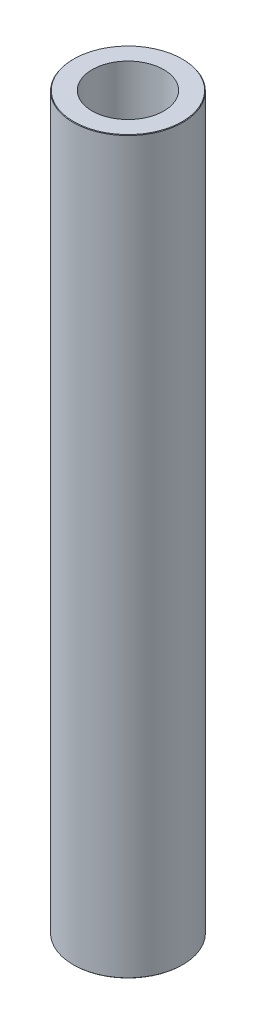
ISO-10303-21;
HEADER;
FILE_DESCRIPTION(('STEP AP214'),'2;1');
FILE_NAME('part.step','',(''),(''),'','','');
FILE_SCHEMA(('AUTOMOTIVE_DESIGN { 1 0 10303 214 1 1 1 1 }'));
ENDSEC;
DATA;
#1=APPLICATION_CONTEXT('core data for automotive mechanical design processes');
#2=APPLICATION_PROTOCOL_DEFINITION('international standard','automotive_design',2000,#1);
#3=PRODUCT_CONTEXT('',#1,'mechanical');
#4=PRODUCT('Part','Part','',(#3));
#5=PRODUCT_RELATED_PRODUCT_CATEGORY('part','',(#4));
#6=PRODUCT_DEFINITION_FORMATION('','',#4);
#7=PRODUCT_DEFINITION_CONTEXT('part definition',#1,'design');
#8=PRODUCT_DEFINITION('design','',#6,#7);
#9=PRODUCT_DEFINITION_SHAPE('','',#8);
#10=(LENGTH_UNIT() NAMED_UNIT(*) SI_UNIT(.MILLI.,.METRE.));
#11=(NAMED_UNIT(*) PLANE_ANGLE_UNIT() SI_UNIT($,.RADIAN.));
#12=(NAMED_UNIT(*) SI_UNIT($,.STERADIAN.) SOLID_ANGLE_UNIT());
#13=UNCERTAINTY_MEASURE_WITH_UNIT(LENGTH_MEASURE(1.E-05),#10,'distance_accuracy_value','');
#14=(GEOMETRIC_REPRESENTATION_CONTEXT(3) GLOBAL_UNCERTAINTY_ASSIGNED_CONTEXT((#13)) GLOBAL_UNIT_ASSIGNED_CONTEXT((#10,
#11,#12)) REPRESENTATION_CONTEXT('',''));
#15=CARTESIAN_POINT('',(0.,0.,0.));
#16=DIRECTION('',(0.,0.,1.));
#17=DIRECTION('',(1.,0.,0.));
#18=AXIS2_PLACEMENT_3D('',#15,#16,#17);
#19=CARTESIAN_POINT('',(0.,600.,0.));
#20=DIRECTION('',(0.,-1.,0.));
#21=DIRECTION('',(0.,0.,-1.));
#22=AXIS2_PLACEMENT_3D('',#19,#20,#21);
#23=CYLINDRICAL_SURFACE('',#22,45.);
#24=CARTESIAN_POINT('',(0.,599.576630556436,0.));
#25=DIRECTION('',(0.,1.,0.));
#26=DIRECTION('',(0.,0.,1.));
#27=AXIS2_PLACEMENT_3D('',#24,#25,#26);
#28=CIRCLE('',#27,45.);
#29=CARTESIAN_POINT('',(0.,599.576630556436,45.));
#30=VERTEX_POINT('',#29);
#31=EDGE_CURVE('E50',#30,#30,#28,.F.);
#32=ORIENTED_EDGE('',*,*,#31,.T.);
#33=EDGE_LOOP('',(#32));
#34=FACE_BOUND('',#33,.T.);
#35=CARTESIAN_POINT('',(0.,0.423369443564026,0.));
#36=DIRECTION('',(0.,1.,0.));
#37=DIRECTION('',(0.,0.,1.));
#38=AXIS2_PLACEMENT_3D('',#35,#36,#37);
#39=CIRCLE('',#38,45.);
#40=CARTESIAN_POINT('',(0.,0.423369443564026,45.));
#41=VERTEX_POINT('',#40);
#42=EDGE_CURVE('E51',#41,#41,#39,.T.);
#43=ORIENTED_EDGE('',*,*,#42,.T.);
#44=EDGE_LOOP('',(#43));
#45=FACE_BOUND('',#44,.T.);
#46=ADVANCED_FACE('F39',(#34,#45),#23,.T.);
#47=CARTESIAN_POINT('',(0.,600.,0.));
#48=DIRECTION('',(0.,1.,0.));
#49=DIRECTION('',(0.,0.,1.));
#50=AXIS2_PLACEMENT_3D('',#47,#48,#49);
#51=PLANE('',#50);
#52=CARTESIAN_POINT('',(0.,600.,0.));
#53=DIRECTION('',(0.,1.,0.));
#54=DIRECTION('',(0.,0.,1.));
#55=AXIS2_PLACEMENT_3D('',#52,#53,#54);
#56=CIRCLE('',#55,44.5766305564361);
#57=CARTESIAN_POINT('',(0.,600.,44.5766305564361));
#58=VERTEX_POINT('',#57);
#59=EDGE_CURVE('E54',#58,#58,#56,.T.);
#60=ORIENTED_EDGE('',*,*,#59,.T.);
#61=EDGE_LOOP('',(#60));
#62=FACE_BOUND('',#61,.T.);
#63=CARTESIAN_POINT('',(0.,600.,0.));
#64=DIRECTION('',(0.,1.,0.));
#65=DIRECTION('',(0.,0.,1.));
#66=AXIS2_PLACEMENT_3D('',#63,#64,#65);
#67=CIRCLE('',#66,29.4479606717467);
#68=CARTESIAN_POINT('',(0.,600.,29.4479606717467));
#69=VERTEX_POINT('',#68);
#70=EDGE_CURVE('E58',#69,#69,#67,.T.);
#71=ORIENTED_EDGE('',*,*,#70,.F.);
#72=EDGE_LOOP('',(#71));
#73=FACE_BOUND('',#72,.T.);
#74=ADVANCED_FACE('F69',(#62,#73),#51,.T.);
#75=CARTESIAN_POINT('',(0.,0.,0.));
#76=DIRECTION('',(0.,1.,0.));
#77=DIRECTION('',(0.,0.,1.));
#78=AXIS2_PLACEMENT_3D('',#75,#76,#77);
#79=PLANE('',#78);
#80=CARTESIAN_POINT('',(0.,0.,0.));
#81=DIRECTION('',(0.,1.,0.));
#82=DIRECTION('',(0.,0.,1.));
#83=AXIS2_PLACEMENT_3D('',#80,#81,#82);
#84=CIRCLE('',#83,44.576630556436);
#85=CARTESIAN_POINT('',(0.,0.,44.576630556436));
#86=VERTEX_POINT('',#85);
#87=EDGE_CURVE('E10',#86,#86,#84,.F.);
#88=ORIENTED_EDGE('',*,*,#87,.T.);
#89=EDGE_LOOP('',(#88));
#90=FACE_BOUND('',#89,.T.);
#91=CARTESIAN_POINT('',(0.,0.,0.));
#92=DIRECTION('',(0.,1.,0.));
#93=DIRECTION('',(0.,0.,1.));
#94=AXIS2_PLACEMENT_3D('',#91,#92,#93);
#95=CIRCLE('',#94,29.4479606717467);
#96=CARTESIAN_POINT('',(0.,0.,29.4479606717467));
#97=VERTEX_POINT('',#96);
#98=EDGE_CURVE('E63',#97,#97,#95,.T.);
#99=ORIENTED_EDGE('',*,*,#98,.T.);
#100=EDGE_LOOP('',(#99));
#101=FACE_BOUND('',#100,.T.);
#102=ADVANCED_FACE('F75',(#90,#101),#79,.F.);
#103=CARTESIAN_POINT('',(0.,600.,0.));
#104=DIRECTION('',(0.,-1.,0.));
#105=DIRECTION('',(0.,0.,-1.));
#106=AXIS2_PLACEMENT_3D('',#103,#104,#105);
#107=CYLINDRICAL_SURFACE('',#106,29.4479606717467);
#108=ORIENTED_EDGE('',*,*,#70,.T.);
#109=EDGE_LOOP('',(#108));
#110=FACE_BOUND('',#109,.T.);
#111=ORIENTED_EDGE('',*,*,#98,.F.);
#112=EDGE_LOOP('',(#111));
#113=FACE_BOUND('',#112,.T.);
#114=ADVANCED_FACE('F70',(#110,#113),#107,.F.);
#115=CARTESIAN_POINT('',(0.,600.,0.));
#116=DIRECTION('',(0.,-1.,0.));
#117=DIRECTION('',(0.,0.,-1.));
#118=AXIS2_PLACEMENT_3D('',#115,#116,#117);
#119=CONICAL_SURFACE('',#118,44.5766305564361,0.785398163397407);
#120=ORIENTED_EDGE('',*,*,#31,.F.);
#121=EDGE_LOOP('',(#120));
#122=FACE_BOUND('',#121,.T.);
#123=ORIENTED_EDGE('',*,*,#59,.F.);
#124=EDGE_LOOP('',(#123));
#125=FACE_BOUND('',#124,.T.);
#126=ADVANCED_FACE('F81',(#122,#125),#119,.T.);
#127=CARTESIAN_POINT('',(0.,0.423369443564026,0.));
#128=DIRECTION('',(0.,1.,0.));
#129=DIRECTION('',(0.,0.,1.));
#130=AXIS2_PLACEMENT_3D('',#127,#128,#129);
#131=CONICAL_SURFACE('',#130,45.,0.785398163397416);
#132=ORIENTED_EDGE('',*,*,#87,.F.);
#133=EDGE_LOOP('',(#132));
#134=FACE_BOUND('',#133,.T.);
#135=ORIENTED_EDGE('',*,*,#42,.F.);
#136=EDGE_LOOP('',(#135));
#137=FACE_BOUND('',#136,.T.);
#138=ADVANCED_FACE('F45',(#134,#137),#131,.T.);
#139=CLOSED_SHELL('',(#46,#74,#102,#114,#126,#138));
#140=MANIFOLD_SOLID_BREP('B2',#139);
#141=ADVANCED_BREP_SHAPE_REPRESENTATION('',(#18,#140),#14);
#142=SHAPE_DEFINITION_REPRESENTATION(#9,#141);
ENDSEC;
END-ISO-10303-21;
